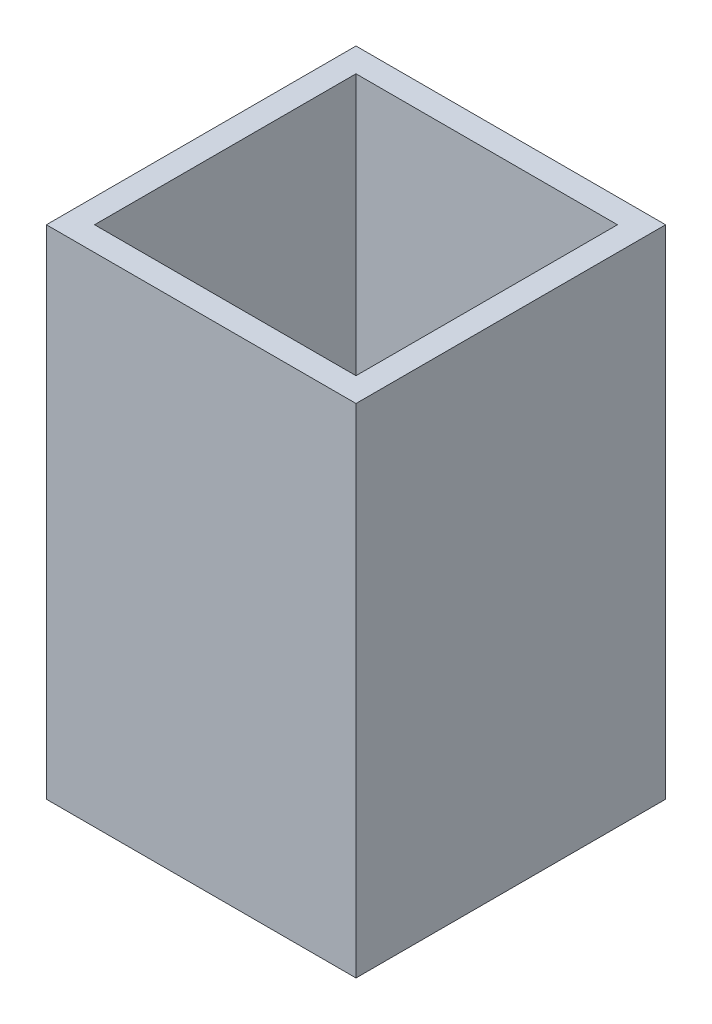
ISO-10303-21;
HEADER;
FILE_DESCRIPTION(('STEP AP214'),'2;1');
FILE_NAME('part.step','',(''),(''),'','','');
FILE_SCHEMA(('AUTOMOTIVE_DESIGN { 1 0 10303 214 1 1 1 1 }'));
ENDSEC;
DATA;
#1=APPLICATION_CONTEXT('core data for automotive mechanical design processes');
#2=APPLICATION_PROTOCOL_DEFINITION('international standard','automotive_design',2000,#1);
#3=PRODUCT_CONTEXT('',#1,'mechanical');
#4=PRODUCT('Part','Part','',(#3));
#5=PRODUCT_RELATED_PRODUCT_CATEGORY('part','',(#4));
#6=PRODUCT_DEFINITION_FORMATION('','',#4);
#7=PRODUCT_DEFINITION_CONTEXT('part definition',#1,'design');
#8=PRODUCT_DEFINITION('design','',#6,#7);
#9=PRODUCT_DEFINITION_SHAPE('','',#8);
#10=(LENGTH_UNIT() NAMED_UNIT(*) SI_UNIT(.MILLI.,.METRE.));
#11=(NAMED_UNIT(*) PLANE_ANGLE_UNIT() SI_UNIT($,.RADIAN.));
#12=(NAMED_UNIT(*) SI_UNIT($,.STERADIAN.) SOLID_ANGLE_UNIT());
#13=UNCERTAINTY_MEASURE_WITH_UNIT(LENGTH_MEASURE(1.E-05),#10,'distance_accuracy_value','');
#14=(GEOMETRIC_REPRESENTATION_CONTEXT(3) GLOBAL_UNCERTAINTY_ASSIGNED_CONTEXT((#13)) GLOBAL_UNIT_ASSIGNED_CONTEXT((#10,
#11,#12)) REPRESENTATION_CONTEXT('',''));
#15=CARTESIAN_POINT('',(0.,0.,0.));
#16=DIRECTION('',(0.,0.,1.));
#17=DIRECTION('',(1.,0.,0.));
#18=AXIS2_PLACEMENT_3D('',#15,#16,#17);
#19=CARTESIAN_POINT('',(0.,18.,0.));
#20=DIRECTION('',(0.,1.,0.));
#21=DIRECTION('',(-1.,0.,0.));
#22=AXIS2_PLACEMENT_3D('',#19,#20,#21);
#23=PLANE('',#22);
#24=DIRECTION('',(0.,0.,-1.));
#25=VECTOR('',#24,1.);
#26=CARTESIAN_POINT('',(17.0792071759051,18.,0.));
#27=LINE('',#26,#25);
#28=CARTESIAN_POINT('',(17.0792071759051,18.,17.0792071759051));
#29=VERTEX_POINT('',#28);
#30=CARTESIAN_POINT('',(17.0792071759051,18.,-17.0792071759051));
#31=VERTEX_POINT('',#30);
#32=EDGE_CURVE('E154',#29,#31,#27,.T.);
#33=ORIENTED_EDGE('',*,*,#32,.T.);
#34=DIRECTION('',(-1.,0.,0.));
#35=VECTOR('',#34,1.);
#36=CARTESIAN_POINT('',(37.,18.,-17.0792071759051));
#37=LINE('',#36,#35);
#38=CARTESIAN_POINT('',(-17.0792071759051,18.,-17.0792071759051));
#39=VERTEX_POINT('',#38);
#40=EDGE_CURVE('E157',#31,#39,#37,.T.);
#41=ORIENTED_EDGE('',*,*,#40,.T.);
#42=DIRECTION('',(0.,0.,-1.));
#43=VECTOR('',#42,1.);
#44=CARTESIAN_POINT('',(-17.0792071759051,18.,0.));
#45=LINE('',#44,#43);
#46=CARTESIAN_POINT('',(-17.0792071759051,18.,17.0792071759051));
#47=VERTEX_POINT('',#46);
#48=EDGE_CURVE('E41',#47,#39,#45,.T.);
#49=ORIENTED_EDGE('',*,*,#48,.F.);
#50=DIRECTION('',(-1.,0.,0.));
#51=VECTOR('',#50,1.);
#52=CARTESIAN_POINT('',(37.,18.,17.0792071759051));
#53=LINE('',#52,#51);
#54=EDGE_CURVE('E11',#29,#47,#53,.T.);
#55=ORIENTED_EDGE('',*,*,#54,.F.);
#56=EDGE_LOOP('',(#33,#41,#49,#55));
#57=FACE_BOUND('',#56,.T.);
#58=ADVANCED_FACE('F33',(#57),#23,.T.);
#59=CARTESIAN_POINT('',(0.,78.,0.));
#60=DIRECTION('',(0.,1.,0.));
#61=DIRECTION('',(-1.,0.,0.));
#62=AXIS2_PLACEMENT_3D('',#59,#60,#61);
#63=PLANE('',#62);
#64=DIRECTION('',(0.,0.,-1.));
#65=VECTOR('',#64,1.);
#66=CARTESIAN_POINT('',(20.2232884948966,78.,0.));
#67=LINE('',#66,#65);
#68=CARTESIAN_POINT('',(20.2232884948966,78.,20.2232884948966));
#69=VERTEX_POINT('',#68);
#70=CARTESIAN_POINT('',(20.2232884948966,78.,-20.2232884948966));
#71=VERTEX_POINT('',#70);
#72=EDGE_CURVE('E125',#69,#71,#67,.T.);
#73=ORIENTED_EDGE('',*,*,#72,.T.);
#74=DIRECTION('',(-1.,0.,0.));
#75=VECTOR('',#74,1.);
#76=CARTESIAN_POINT('',(37.,78.,-20.2232884948966));
#77=LINE('',#76,#75);
#78=CARTESIAN_POINT('',(-20.2232884948966,78.,-20.2232884948966));
#79=VERTEX_POINT('',#78);
#80=EDGE_CURVE('E128',#71,#79,#77,.T.);
#81=ORIENTED_EDGE('',*,*,#80,.T.);
#82=DIRECTION('',(0.,0.,1.));
#83=VECTOR('',#82,1.);
#84=CARTESIAN_POINT('',(-20.2232884948966,78.,0.));
#85=LINE('',#84,#83);
#86=CARTESIAN_POINT('',(-20.2232884948966,78.,20.2232884948966));
#87=VERTEX_POINT('',#86);
#88=EDGE_CURVE('E131',#79,#87,#85,.T.);
#89=ORIENTED_EDGE('',*,*,#88,.T.);
#90=DIRECTION('',(1.,0.,0.));
#91=VECTOR('',#90,1.);
#92=CARTESIAN_POINT('',(37.,78.,20.2232884948966));
#93=LINE('',#92,#91);
#94=EDGE_CURVE('E133',#87,#69,#93,.T.);
#95=ORIENTED_EDGE('',*,*,#94,.T.);
#96=EDGE_LOOP('',(#73,#81,#89,#95));
#97=FACE_BOUND('',#96,.T.);
#98=DIRECTION('',(1.,0.,0.));
#99=VECTOR('',#98,1.);
#100=CARTESIAN_POINT('',(37.,78.,17.0792071759051));
#101=LINE('',#100,#99);
#102=CARTESIAN_POINT('',(-17.0792071759051,78.,17.0792071759051));
#103=VERTEX_POINT('',#102);
#104=CARTESIAN_POINT('',(17.0792071759051,78.,17.0792071759051));
#105=VERTEX_POINT('',#104);
#106=EDGE_CURVE('E104',#103,#105,#101,.T.);
#107=ORIENTED_EDGE('',*,*,#106,.F.);
#108=DIRECTION('',(0.,0.,1.));
#109=VECTOR('',#108,1.);
#110=CARTESIAN_POINT('',(-17.0792071759051,78.,0.));
#111=LINE('',#110,#109);
#112=CARTESIAN_POINT('',(-17.0792071759051,78.,-17.0792071759051));
#113=VERTEX_POINT('',#112);
#114=EDGE_CURVE('E97',#113,#103,#111,.T.);
#115=ORIENTED_EDGE('',*,*,#114,.F.);
#116=DIRECTION('',(-1.,0.,0.));
#117=VECTOR('',#116,1.);
#118=CARTESIAN_POINT('',(37.,78.,-17.0792071759051));
#119=LINE('',#118,#117);
#120=CARTESIAN_POINT('',(17.0792071759051,78.,-17.0792071759051));
#121=VERTEX_POINT('',#120);
#122=EDGE_CURVE('E116',#121,#113,#119,.T.);
#123=ORIENTED_EDGE('',*,*,#122,.F.);
#124=DIRECTION('',(0.,0.,-1.));
#125=VECTOR('',#124,1.);
#126=CARTESIAN_POINT('',(17.0792071759051,78.,0.));
#127=LINE('',#126,#125);
#128=EDGE_CURVE('E114',#105,#121,#127,.T.);
#129=ORIENTED_EDGE('',*,*,#128,.F.);
#130=EDGE_LOOP('',(#107,#115,#123,#129));
#131=FACE_BOUND('',#130,.T.);
#132=ADVANCED_FACE('F112',(#97,#131),#63,.T.);
#133=CARTESIAN_POINT('',(20.2232884948966,78.,0.));
#134=DIRECTION('',(-1.,0.,0.));
#135=DIRECTION('',(0.,0.,1.));
#136=AXIS2_PLACEMENT_3D('',#133,#134,#135);
#137=PLANE('',#136);
#138=DIRECTION('',(0.,0.,-1.));
#139=VECTOR('',#138,1.);
#140=CARTESIAN_POINT('',(20.2232884948966,13.,0.));
#141=LINE('',#140,#139);
#142=CARTESIAN_POINT('',(20.2232884948966,13.,20.2232884948966));
#143=VERTEX_POINT('',#142);
#144=CARTESIAN_POINT('',(20.2232884948966,13.,-20.2232884948966));
#145=VERTEX_POINT('',#144);
#146=EDGE_CURVE('E108',#143,#145,#141,.T.);
#147=ORIENTED_EDGE('',*,*,#146,.T.);
#148=DIRECTION('',(0.,-1.,0.));
#149=VECTOR('',#148,1.);
#150=CARTESIAN_POINT('',(20.2232884948966,78.,-20.2232884948966));
#151=LINE('',#150,#149);
#152=EDGE_CURVE('E151',#71,#145,#151,.T.);
#153=ORIENTED_EDGE('',*,*,#152,.F.);
#154=ORIENTED_EDGE('',*,*,#72,.F.);
#155=DIRECTION('',(0.,-1.,0.));
#156=VECTOR('',#155,1.);
#157=CARTESIAN_POINT('',(20.2232884948966,78.,20.2232884948966));
#158=LINE('',#157,#156);
#159=EDGE_CURVE('E135',#69,#143,#158,.T.);
#160=ORIENTED_EDGE('',*,*,#159,.T.);
#161=EDGE_LOOP('',(#147,#153,#154,#160));
#162=FACE_BOUND('',#161,.T.);
#163=ADVANCED_FACE('F175',(#162),#137,.F.);
#164=CARTESIAN_POINT('',(37.,78.,-20.2232884948966));
#165=DIRECTION('',(0.,0.,1.));
#166=DIRECTION('',(1.,0.,0.));
#167=AXIS2_PLACEMENT_3D('',#164,#165,#166);
#168=PLANE('',#167);
#169=DIRECTION('',(-1.,0.,0.));
#170=VECTOR('',#169,1.);
#171=CARTESIAN_POINT('',(37.,13.,-20.2232884948966));
#172=LINE('',#171,#170);
#173=CARTESIAN_POINT('',(-20.2232884948966,13.,-20.2232884948966));
#174=VERTEX_POINT('',#173);
#175=EDGE_CURVE('E138',#145,#174,#172,.T.);
#176=ORIENTED_EDGE('',*,*,#175,.T.);
#177=DIRECTION('',(0.,-1.,0.));
#178=VECTOR('',#177,1.);
#179=CARTESIAN_POINT('',(-20.2232884948966,78.,-20.2232884948966));
#180=LINE('',#179,#178);
#181=EDGE_CURVE('E148',#79,#174,#180,.T.);
#182=ORIENTED_EDGE('',*,*,#181,.F.);
#183=ORIENTED_EDGE('',*,*,#80,.F.);
#184=ORIENTED_EDGE('',*,*,#152,.T.);
#185=EDGE_LOOP('',(#176,#182,#183,#184));
#186=FACE_BOUND('',#185,.T.);
#187=ADVANCED_FACE('F181',(#186),#168,.F.);
#188=CARTESIAN_POINT('',(-20.2232884948966,78.,0.));
#189=DIRECTION('',(1.,0.,0.));
#190=DIRECTION('',(0.,0.,-1.));
#191=AXIS2_PLACEMENT_3D('',#188,#189,#190);
#192=PLANE('',#191);
#193=DIRECTION('',(0.,0.,1.));
#194=VECTOR('',#193,1.);
#195=CARTESIAN_POINT('',(-20.2232884948966,13.,0.));
#196=LINE('',#195,#194);
#197=CARTESIAN_POINT('',(-20.2232884948966,13.,20.2232884948966));
#198=VERTEX_POINT('',#197);
#199=EDGE_CURVE('E140',#174,#198,#196,.T.);
#200=ORIENTED_EDGE('',*,*,#199,.T.);
#201=DIRECTION('',(0.,-1.,0.));
#202=VECTOR('',#201,1.);
#203=CARTESIAN_POINT('',(-20.2232884948966,78.,20.2232884948966));
#204=LINE('',#203,#202);
#205=EDGE_CURVE('E145',#87,#198,#204,.T.);
#206=ORIENTED_EDGE('',*,*,#205,.F.);
#207=ORIENTED_EDGE('',*,*,#88,.F.);
#208=ORIENTED_EDGE('',*,*,#181,.T.);
#209=EDGE_LOOP('',(#200,#206,#207,#208));
#210=FACE_BOUND('',#209,.T.);
#211=ADVANCED_FACE('F185',(#210),#192,.F.);
#212=CARTESIAN_POINT('',(37.,78.,20.2232884948966));
#213=DIRECTION('',(0.,0.,-1.));
#214=DIRECTION('',(-1.,0.,0.));
#215=AXIS2_PLACEMENT_3D('',#212,#213,#214);
#216=PLANE('',#215);
#217=DIRECTION('',(1.,0.,0.));
#218=VECTOR('',#217,1.);
#219=CARTESIAN_POINT('',(37.,13.,20.2232884948966));
#220=LINE('',#219,#218);
#221=EDGE_CURVE('E129',#198,#143,#220,.T.);
#222=ORIENTED_EDGE('',*,*,#221,.T.);
#223=ORIENTED_EDGE('',*,*,#159,.F.);
#224=ORIENTED_EDGE('',*,*,#94,.F.);
#225=ORIENTED_EDGE('',*,*,#205,.T.);
#226=EDGE_LOOP('',(#222,#223,#224,#225));
#227=FACE_BOUND('',#226,.T.);
#228=ADVANCED_FACE('F189',(#227),#216,.F.);
#229=CARTESIAN_POINT('',(-17.0792071759051,78.,0.));
#230=DIRECTION('',(1.,0.,0.));
#231=DIRECTION('',(0.,0.,-1.));
#232=AXIS2_PLACEMENT_3D('',#229,#230,#231);
#233=PLANE('',#232);
#234=DIRECTION('',(0.,-1.,0.));
#235=VECTOR('',#234,1.);
#236=CARTESIAN_POINT('',(-17.0792071759051,78.,17.0792071759051));
#237=LINE('',#236,#235);
#238=EDGE_CURVE('E99',#103,#47,#237,.T.);
#239=ORIENTED_EDGE('',*,*,#238,.T.);
#240=ORIENTED_EDGE('',*,*,#48,.T.);
#241=DIRECTION('',(0.,-1.,0.));
#242=VECTOR('',#241,1.);
#243=CARTESIAN_POINT('',(-17.0792071759051,78.,-17.0792071759051));
#244=LINE('',#243,#242);
#245=EDGE_CURVE('E48',#113,#39,#244,.T.);
#246=ORIENTED_EDGE('',*,*,#245,.F.);
#247=ORIENTED_EDGE('',*,*,#114,.T.);
#248=EDGE_LOOP('',(#239,#240,#246,#247));
#249=FACE_BOUND('',#248,.T.);
#250=ADVANCED_FACE('F98',(#249),#233,.T.);
#251=CARTESIAN_POINT('',(37.,78.,17.0792071759051));
#252=DIRECTION('',(0.,0.,-1.));
#253=DIRECTION('',(-1.,0.,0.));
#254=AXIS2_PLACEMENT_3D('',#251,#252,#253);
#255=PLANE('',#254);
#256=DIRECTION('',(0.,-1.,0.));
#257=VECTOR('',#256,1.);
#258=CARTESIAN_POINT('',(17.0792071759051,78.,17.0792071759051));
#259=LINE('',#258,#257);
#260=EDGE_CURVE('E109',#105,#29,#259,.T.);
#261=ORIENTED_EDGE('',*,*,#260,.T.);
#262=ORIENTED_EDGE('',*,*,#54,.T.);
#263=ORIENTED_EDGE('',*,*,#238,.F.);
#264=ORIENTED_EDGE('',*,*,#106,.T.);
#265=EDGE_LOOP('',(#261,#262,#263,#264));
#266=FACE_BOUND('',#265,.T.);
#267=ADVANCED_FACE('F106',(#266),#255,.T.);
#268=CARTESIAN_POINT('',(17.0792071759051,78.,0.));
#269=DIRECTION('',(-1.,0.,0.));
#270=DIRECTION('',(0.,0.,1.));
#271=AXIS2_PLACEMENT_3D('',#268,#269,#270);
#272=PLANE('',#271);
#273=DIRECTION('',(0.,-1.,0.));
#274=VECTOR('',#273,1.);
#275=CARTESIAN_POINT('',(17.0792071759051,78.,-17.0792071759051));
#276=LINE('',#275,#274);
#277=EDGE_CURVE('E121',#121,#31,#276,.T.);
#278=ORIENTED_EDGE('',*,*,#277,.T.);
#279=ORIENTED_EDGE('',*,*,#32,.F.);
#280=ORIENTED_EDGE('',*,*,#260,.F.);
#281=ORIENTED_EDGE('',*,*,#128,.T.);
#282=EDGE_LOOP('',(#278,#279,#280,#281));
#283=FACE_BOUND('',#282,.T.);
#284=ADVANCED_FACE('F162',(#283),#272,.T.);
#285=CARTESIAN_POINT('',(37.,78.,-17.0792071759051));
#286=DIRECTION('',(0.,0.,1.));
#287=DIRECTION('',(1.,0.,0.));
#288=AXIS2_PLACEMENT_3D('',#285,#286,#287);
#289=PLANE('',#288);
#290=ORIENTED_EDGE('',*,*,#245,.T.);
#291=ORIENTED_EDGE('',*,*,#40,.F.);
#292=ORIENTED_EDGE('',*,*,#277,.F.);
#293=ORIENTED_EDGE('',*,*,#122,.T.);
#294=EDGE_LOOP('',(#290,#291,#292,#293));
#295=FACE_BOUND('',#294,.T.);
#296=ADVANCED_FACE('F160',(#295),#289,.T.);
#297=CARTESIAN_POINT('',(0.,13.,0.));
#298=DIRECTION('',(0.,1.,0.));
#299=DIRECTION('',(-1.,0.,0.));
#300=AXIS2_PLACEMENT_3D('',#297,#298,#299);
#301=PLANE('',#300);
#302=ORIENTED_EDGE('',*,*,#146,.F.);
#303=ORIENTED_EDGE('',*,*,#221,.F.);
#304=ORIENTED_EDGE('',*,*,#199,.F.);
#305=ORIENTED_EDGE('',*,*,#175,.F.);
#306=EDGE_LOOP('',(#302,#303,#304,#305));
#307=FACE_BOUND('',#306,.T.);
#308=ADVANCED_FACE('F35',(#307),#301,.F.);
#309=CLOSED_SHELL('',(#58,#132,#163,#187,#211,#228,#250,#267,#284,#296,#308));
#310=MANIFOLD_SOLID_BREP('B2',#309);
#311=ADVANCED_BREP_SHAPE_REPRESENTATION('',(#18,#310),#14);
#312=SHAPE_DEFINITION_REPRESENTATION(#9,#311);
ENDSEC;
END-ISO-10303-21;
